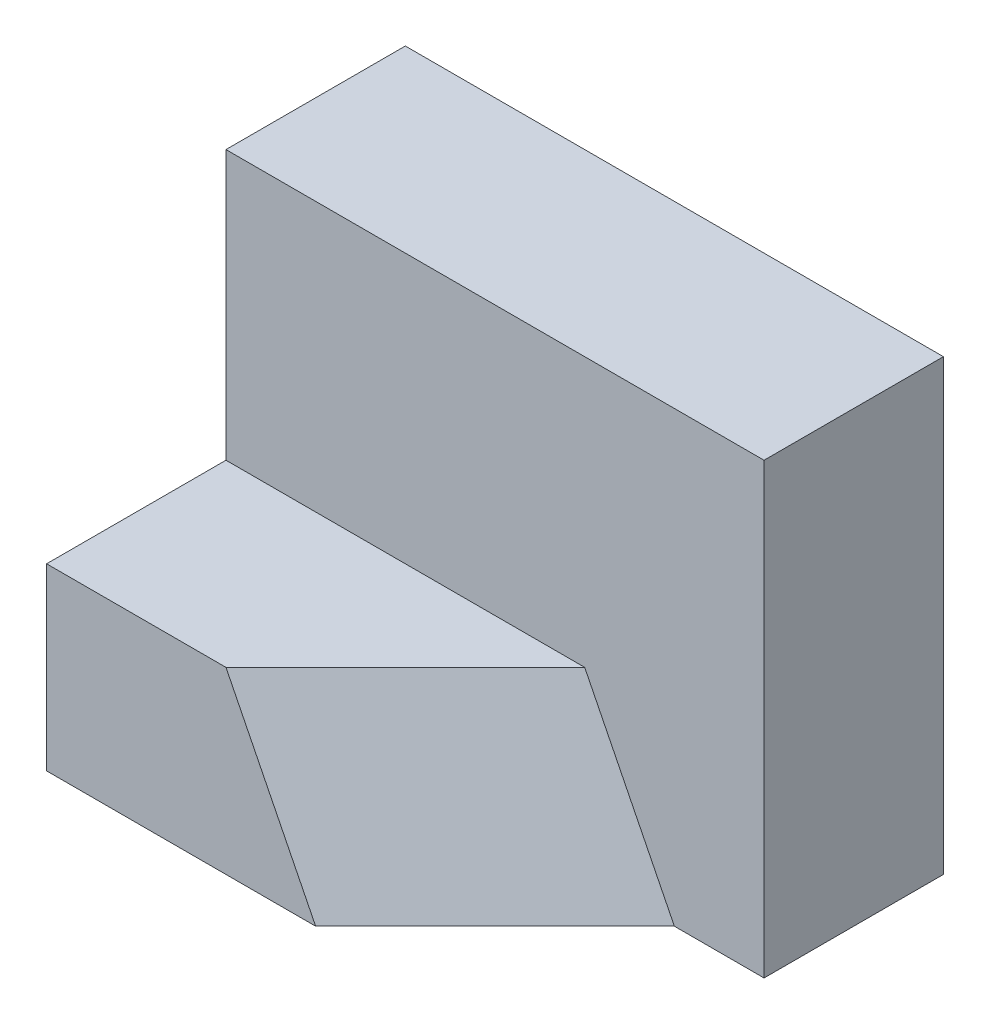
ISO-10303-21;
HEADER;
FILE_DESCRIPTION(('STEP AP214'),'2;1');
FILE_NAME('part.step','',(''),(''),'','','');
FILE_SCHEMA(('AUTOMOTIVE_DESIGN { 1 0 10303 214 1 1 1 1 }'));
ENDSEC;
DATA;
#1=APPLICATION_CONTEXT('core data for automotive mechanical design processes');
#2=APPLICATION_PROTOCOL_DEFINITION('international standard','automotive_design',2000,#1);
#3=PRODUCT_CONTEXT('',#1,'mechanical');
#4=PRODUCT('Part','Part','',(#3));
#5=PRODUCT_RELATED_PRODUCT_CATEGORY('part','',(#4));
#6=PRODUCT_DEFINITION_FORMATION('','',#4);
#7=PRODUCT_DEFINITION_CONTEXT('part definition',#1,'design');
#8=PRODUCT_DEFINITION('design','',#6,#7);
#9=PRODUCT_DEFINITION_SHAPE('','',#8);
#10=(LENGTH_UNIT() NAMED_UNIT(*) SI_UNIT(.MILLI.,.METRE.));
#11=(NAMED_UNIT(*) PLANE_ANGLE_UNIT() SI_UNIT($,.RADIAN.));
#12=(NAMED_UNIT(*) SI_UNIT($,.STERADIAN.) SOLID_ANGLE_UNIT());
#13=UNCERTAINTY_MEASURE_WITH_UNIT(LENGTH_MEASURE(1.E-05),#10,'distance_accuracy_value','');
#14=(GEOMETRIC_REPRESENTATION_CONTEXT(3) GLOBAL_UNCERTAINTY_ASSIGNED_CONTEXT((#13)) GLOBAL_UNIT_ASSIGNED_CONTEXT((#10,
#11,#12)) REPRESENTATION_CONTEXT('',''));
#15=CARTESIAN_POINT('',(0.,0.,0.));
#16=DIRECTION('',(0.,0.,1.));
#17=DIRECTION('',(1.,0.,0.));
#18=AXIS2_PLACEMENT_3D('',#15,#16,#17);
#19=CARTESIAN_POINT('',(0.,0.,2.));
#20=DIRECTION('',(0.,0.,-1.));
#21=DIRECTION('',(-1.,0.,0.));
#22=AXIS2_PLACEMENT_3D('',#19,#20,#21);
#23=PLANE('',#22);
#24=DIRECTION('',(0.,1.,0.));
#25=VECTOR('',#24,1.);
#26=CARTESIAN_POINT('',(6.,0.,2.));
#27=LINE('',#26,#25);
#28=CARTESIAN_POINT('',(6.,0.,2.));
#29=VERTEX_POINT('',#28);
#30=CARTESIAN_POINT('',(6.,5.,2.));
#31=VERTEX_POINT('',#30);
#32=EDGE_CURVE('E141',#29,#31,#27,.T.);
#33=ORIENTED_EDGE('',*,*,#32,.T.);
#34=DIRECTION('',(-1.,0.,0.));
#35=VECTOR('',#34,1.);
#36=CARTESIAN_POINT('',(0.,5.,2.));
#37=LINE('',#36,#35);
#38=CARTESIAN_POINT('',(0.,5.,2.));
#39=VERTEX_POINT('',#38);
#40=EDGE_CURVE('E143',#31,#39,#37,.T.);
#41=ORIENTED_EDGE('',*,*,#40,.T.);
#42=DIRECTION('',(0.,-1.,0.));
#43=VECTOR('',#42,1.);
#44=CARTESIAN_POINT('',(0.,0.,2.));
#45=LINE('',#44,#43);
#46=CARTESIAN_POINT('',(0.,2.,2.));
#47=VERTEX_POINT('',#46);
#48=EDGE_CURVE('E60',#39,#47,#45,.T.);
#49=ORIENTED_EDGE('',*,*,#48,.T.);
#50=DIRECTION('',(-1.,0.,0.));
#51=VECTOR('',#50,1.);
#52=CARTESIAN_POINT('',(0.,2.,2.));
#53=LINE('',#52,#51);
#54=CARTESIAN_POINT('',(4.,2.,2.));
#55=VERTEX_POINT('',#54);
#56=EDGE_CURVE('E107',#55,#47,#53,.T.);
#57=ORIENTED_EDGE('',*,*,#56,.F.);
#58=DIRECTION('',(0.447213595499958,-0.894427190999916,0.));
#59=VECTOR('',#58,1.);
#60=CARTESIAN_POINT('',(4.,2.,2.));
#61=LINE('',#60,#59);
#62=CARTESIAN_POINT('',(5.,0.,2.));
#63=VERTEX_POINT('',#62);
#64=EDGE_CURVE('E98',#55,#63,#61,.T.);
#65=ORIENTED_EDGE('',*,*,#64,.T.);
#66=DIRECTION('',(1.,0.,0.));
#67=VECTOR('',#66,1.);
#68=CARTESIAN_POINT('',(5.,0.,2.));
#69=LINE('',#68,#67);
#70=EDGE_CURVE('E104',#63,#29,#69,.T.);
#71=ORIENTED_EDGE('',*,*,#70,.T.);
#72=EDGE_LOOP('',(#33,#41,#49,#57,#65,#71));
#73=FACE_BOUND('',#72,.T.);
#74=ADVANCED_FACE('F34',(#73),#23,.F.);
#75=CARTESIAN_POINT('',(0.,0.,2.));
#76=DIRECTION('',(1.,0.,0.));
#77=DIRECTION('',(0.,0.,-1.));
#78=AXIS2_PLACEMENT_3D('',#75,#76,#77);
#79=PLANE('',#78);
#80=DIRECTION('',(0.,-1.,0.));
#81=VECTOR('',#80,1.);
#82=CARTESIAN_POINT('',(0.,0.,0.));
#83=LINE('',#82,#81);
#84=CARTESIAN_POINT('',(0.,5.,0.));
#85=VERTEX_POINT('',#84);
#86=CARTESIAN_POINT('',(0.,0.,0.));
#87=VERTEX_POINT('',#86);
#88=EDGE_CURVE('E133',#85,#87,#83,.T.);
#89=ORIENTED_EDGE('',*,*,#88,.T.);
#90=DIRECTION('',(0.,0.,-1.));
#91=VECTOR('',#90,1.);
#92=CARTESIAN_POINT('',(0.,0.,2.));
#93=LINE('',#92,#91);
#94=CARTESIAN_POINT('',(0.,0.,4.));
#95=VERTEX_POINT('',#94);
#96=EDGE_CURVE('E12',#95,#87,#93,.T.);
#97=ORIENTED_EDGE('',*,*,#96,.F.);
#98=DIRECTION('',(0.,-1.,0.));
#99=VECTOR('',#98,1.);
#100=CARTESIAN_POINT('',(0.,0.,4.));
#101=LINE('',#100,#99);
#102=CARTESIAN_POINT('',(0.,2.,4.));
#103=VERTEX_POINT('',#102);
#104=EDGE_CURVE('E134',#103,#95,#101,.T.);
#105=ORIENTED_EDGE('',*,*,#104,.F.);
#106=DIRECTION('',(0.,0.,-1.));
#107=VECTOR('',#106,1.);
#108=CARTESIAN_POINT('',(0.,2.,4.));
#109=LINE('',#108,#107);
#110=EDGE_CURVE('E130',#103,#47,#109,.T.);
#111=ORIENTED_EDGE('',*,*,#110,.T.);
#112=ORIENTED_EDGE('',*,*,#48,.F.);
#113=DIRECTION('',(0.,0.,-1.));
#114=VECTOR('',#113,1.);
#115=CARTESIAN_POINT('',(0.,5.,2.));
#116=LINE('',#115,#114);
#117=EDGE_CURVE('E145',#39,#85,#116,.T.);
#118=ORIENTED_EDGE('',*,*,#117,.T.);
#119=EDGE_LOOP('',(#89,#97,#105,#111,#112,#118));
#120=FACE_BOUND('',#119,.T.);
#121=ADVANCED_FACE('F36',(#120),#79,.F.);
#122=CARTESIAN_POINT('',(0.,0.,2.));
#123=DIRECTION('',(0.,1.,0.));
#124=DIRECTION('',(0.,0.,1.));
#125=AXIS2_PLACEMENT_3D('',#122,#123,#124);
#126=PLANE('',#125);
#127=ORIENTED_EDGE('',*,*,#70,.F.);
#128=DIRECTION('',(-0.707106781186548,0.,0.707106781186548));
#129=VECTOR('',#128,1.);
#130=CARTESIAN_POINT('',(5.,0.,2.));
#131=LINE('',#130,#129);
#132=CARTESIAN_POINT('',(3.,0.,4.));
#133=VERTEX_POINT('',#132);
#134=EDGE_CURVE('E95',#63,#133,#131,.T.);
#135=ORIENTED_EDGE('',*,*,#134,.T.);
#136=DIRECTION('',(1.,0.,0.));
#137=VECTOR('',#136,1.);
#138=CARTESIAN_POINT('',(6.,0.,4.));
#139=LINE('',#138,#137);
#140=EDGE_CURVE('E126',#95,#133,#139,.T.);
#141=ORIENTED_EDGE('',*,*,#140,.F.);
#142=ORIENTED_EDGE('',*,*,#96,.T.);
#143=DIRECTION('',(1.,0.,0.));
#144=VECTOR('',#143,1.);
#145=CARTESIAN_POINT('',(0.,0.,0.));
#146=LINE('',#145,#144);
#147=CARTESIAN_POINT('',(6.,0.,0.));
#148=VERTEX_POINT('',#147);
#149=EDGE_CURVE('E148',#87,#148,#146,.T.);
#150=ORIENTED_EDGE('',*,*,#149,.T.);
#151=DIRECTION('',(0.,0.,-1.));
#152=VECTOR('',#151,1.);
#153=CARTESIAN_POINT('',(6.,0.,2.));
#154=LINE('',#153,#152);
#155=EDGE_CURVE('E44',#29,#148,#154,.T.);
#156=ORIENTED_EDGE('',*,*,#155,.F.);
#157=EDGE_LOOP('',(#127,#135,#141,#142,#150,#156));
#158=FACE_BOUND('',#157,.T.);
#159=ADVANCED_FACE('F109',(#158),#126,.F.);
#160=CARTESIAN_POINT('',(6.,0.,2.));
#161=DIRECTION('',(-1.,0.,0.));
#162=DIRECTION('',(0.,0.,1.));
#163=AXIS2_PLACEMENT_3D('',#160,#161,#162);
#164=PLANE('',#163);
#165=DIRECTION('',(0.,1.,0.));
#166=VECTOR('',#165,1.);
#167=CARTESIAN_POINT('',(6.,0.,0.));
#168=LINE('',#167,#166);
#169=CARTESIAN_POINT('',(6.,5.,0.));
#170=VERTEX_POINT('',#169);
#171=EDGE_CURVE('E150',#148,#170,#168,.T.);
#172=ORIENTED_EDGE('',*,*,#171,.T.);
#173=DIRECTION('',(0.,0.,-1.));
#174=VECTOR('',#173,1.);
#175=CARTESIAN_POINT('',(6.,5.,2.));
#176=LINE('',#175,#174);
#177=EDGE_CURVE('E156',#31,#170,#176,.T.);
#178=ORIENTED_EDGE('',*,*,#177,.F.);
#179=ORIENTED_EDGE('',*,*,#32,.F.);
#180=ORIENTED_EDGE('',*,*,#155,.T.);
#181=EDGE_LOOP('',(#172,#178,#179,#180));
#182=FACE_BOUND('',#181,.T.);
#183=ADVANCED_FACE('F161',(#182),#164,.F.);
#184=CARTESIAN_POINT('',(0.,5.,2.));
#185=DIRECTION('',(0.,-1.,0.));
#186=DIRECTION('',(0.,0.,-1.));
#187=AXIS2_PLACEMENT_3D('',#184,#185,#186);
#188=PLANE('',#187);
#189=DIRECTION('',(-1.,0.,0.));
#190=VECTOR('',#189,1.);
#191=CARTESIAN_POINT('',(0.,5.,0.));
#192=LINE('',#191,#190);
#193=EDGE_CURVE('E152',#170,#85,#192,.T.);
#194=ORIENTED_EDGE('',*,*,#193,.T.);
#195=ORIENTED_EDGE('',*,*,#117,.F.);
#196=ORIENTED_EDGE('',*,*,#40,.F.);
#197=ORIENTED_EDGE('',*,*,#177,.T.);
#198=EDGE_LOOP('',(#194,#195,#196,#197));
#199=FACE_BOUND('',#198,.T.);
#200=ADVANCED_FACE('F169',(#199),#188,.F.);
#201=CARTESIAN_POINT('',(0.,0.,0.));
#202=DIRECTION('',(0.,0.,-1.));
#203=DIRECTION('',(-1.,0.,0.));
#204=AXIS2_PLACEMENT_3D('',#201,#202,#203);
#205=PLANE('',#204);
#206=ORIENTED_EDGE('',*,*,#88,.F.);
#207=ORIENTED_EDGE('',*,*,#193,.F.);
#208=ORIENTED_EDGE('',*,*,#171,.F.);
#209=ORIENTED_EDGE('',*,*,#149,.F.);
#210=EDGE_LOOP('',(#206,#207,#208,#209));
#211=FACE_BOUND('',#210,.T.);
#212=ADVANCED_FACE('F166',(#211),#205,.T.);
#213=CARTESIAN_POINT('',(0.,2.,4.));
#214=DIRECTION('',(0.,-1.,0.));
#215=DIRECTION('',(0.,0.,-1.));
#216=AXIS2_PLACEMENT_3D('',#213,#214,#215);
#217=PLANE('',#216);
#218=DIRECTION('',(-1.,0.,0.));
#219=VECTOR('',#218,1.);
#220=CARTESIAN_POINT('',(0.,2.,4.));
#221=LINE('',#220,#219);
#222=CARTESIAN_POINT('',(2.,2.,4.));
#223=VERTEX_POINT('',#222);
#224=EDGE_CURVE('E38',#223,#103,#221,.T.);
#225=ORIENTED_EDGE('',*,*,#224,.F.);
#226=DIRECTION('',(0.707106781186548,0.,-0.707106781186548));
#227=VECTOR('',#226,1.);
#228=CARTESIAN_POINT('',(2.,2.,4.));
#229=LINE('',#228,#227);
#230=EDGE_CURVE('E52',#223,#55,#229,.T.);
#231=ORIENTED_EDGE('',*,*,#230,.T.);
#232=ORIENTED_EDGE('',*,*,#56,.T.);
#233=ORIENTED_EDGE('',*,*,#110,.F.);
#234=EDGE_LOOP('',(#225,#231,#232,#233));
#235=FACE_BOUND('',#234,.T.);
#236=ADVANCED_FACE('F177',(#235),#217,.F.);
#237=CARTESIAN_POINT('',(0.,0.,4.));
#238=DIRECTION('',(0.,0.,-1.));
#239=DIRECTION('',(-1.,0.,0.));
#240=AXIS2_PLACEMENT_3D('',#237,#238,#239);
#241=PLANE('',#240);
#242=ORIENTED_EDGE('',*,*,#140,.T.);
#243=DIRECTION('',(-0.447213595499958,0.894427190999916,0.));
#244=VECTOR('',#243,1.);
#245=CARTESIAN_POINT('',(3.,0.,4.));
#246=LINE('',#245,#244);
#247=EDGE_CURVE('E99',#133,#223,#246,.T.);
#248=ORIENTED_EDGE('',*,*,#247,.T.);
#249=ORIENTED_EDGE('',*,*,#224,.T.);
#250=ORIENTED_EDGE('',*,*,#104,.T.);
#251=EDGE_LOOP('',(#242,#248,#249,#250));
#252=FACE_BOUND('',#251,.T.);
#253=ADVANCED_FACE('F182',(#252),#241,.F.);
#254=CARTESIAN_POINT('',(3.11111111111111,1.55555555555555,3.11111111111111));
#255=DIRECTION('',(-0.666666666666666,-0.333333333333333,-0.666666666666667));
#256=DIRECTION('',(-0.707106781186548,0.,0.707106781186547));
#257=AXIS2_PLACEMENT_3D('',#254,#255,#256);
#258=PLANE('',#257);
#259=ORIENTED_EDGE('',*,*,#230,.F.);
#260=ORIENTED_EDGE('',*,*,#247,.F.);
#261=ORIENTED_EDGE('',*,*,#134,.F.);
#262=ORIENTED_EDGE('',*,*,#64,.F.);
#263=EDGE_LOOP('',(#259,#260,#261,#262));
#264=FACE_BOUND('',#263,.T.);
#265=ADVANCED_FACE('F97',(#264),#258,.F.);
#266=CLOSED_SHELL('',(#74,#121,#159,#183,#200,#212,#236,#253,#265));
#267=MANIFOLD_SOLID_BREP('B2',#266);
#268=ADVANCED_BREP_SHAPE_REPRESENTATION('',(#18,#267),#14);
#269=SHAPE_DEFINITION_REPRESENTATION(#9,#268);
ENDSEC;
END-ISO-10303-21;
